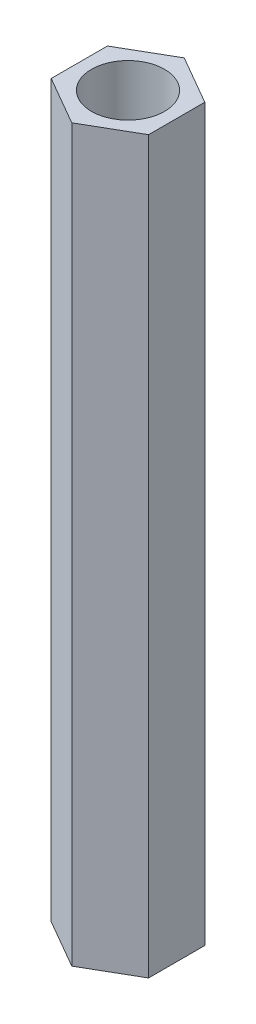
ISO-10303-21;
HEADER;
FILE_DESCRIPTION(('STEP AP214'),'2;1');
FILE_NAME('part.step','',(''),(''),'','','');
FILE_SCHEMA(('AUTOMOTIVE_DESIGN { 1 0 10303 214 1 1 1 1 }'));
ENDSEC;
DATA;
#1=APPLICATION_CONTEXT('core data for automotive mechanical design processes');
#2=APPLICATION_PROTOCOL_DEFINITION('international standard','automotive_design',2000,#1);
#3=PRODUCT_CONTEXT('',#1,'mechanical');
#4=PRODUCT('Part','Part','',(#3));
#5=PRODUCT_RELATED_PRODUCT_CATEGORY('part','',(#4));
#6=PRODUCT_DEFINITION_FORMATION('','',#4);
#7=PRODUCT_DEFINITION_CONTEXT('part definition',#1,'design');
#8=PRODUCT_DEFINITION('design','',#6,#7);
#9=PRODUCT_DEFINITION_SHAPE('','',#8);
#10=(LENGTH_UNIT() NAMED_UNIT(*) SI_UNIT(.MILLI.,.METRE.));
#11=(NAMED_UNIT(*) PLANE_ANGLE_UNIT() SI_UNIT($,.RADIAN.));
#12=(NAMED_UNIT(*) SI_UNIT($,.STERADIAN.) SOLID_ANGLE_UNIT());
#13=UNCERTAINTY_MEASURE_WITH_UNIT(LENGTH_MEASURE(1.E-05),#10,'distance_accuracy_value','');
#14=(GEOMETRIC_REPRESENTATION_CONTEXT(3) GLOBAL_UNCERTAINTY_ASSIGNED_CONTEXT((#13)) GLOBAL_UNIT_ASSIGNED_CONTEXT((#10,
#11,#12)) REPRESENTATION_CONTEXT('',''));
#15=CARTESIAN_POINT('',(0.,0.,0.));
#16=DIRECTION('',(0.,0.,1.));
#17=DIRECTION('',(1.,0.,0.));
#18=AXIS2_PLACEMENT_3D('',#15,#16,#17);
#19=CARTESIAN_POINT('',(0.,30.,0.));
#20=DIRECTION('',(0.,1.,0.));
#21=DIRECTION('',(0.,0.,1.));
#22=AXIS2_PLACEMENT_3D('',#19,#20,#21);
#23=PLANE('',#22);
#24=DIRECTION('',(-0.866025403784439,0.,-0.5));
#25=VECTOR('',#24,1.);
#26=CARTESIAN_POINT('',(2.,30.,-1.15470053837925));
#27=LINE('',#26,#25);
#28=CARTESIAN_POINT('',(2.,30.,-1.15470053837925));
#29=VERTEX_POINT('',#28);
#30=CARTESIAN_POINT('',(0.,30.,-2.3094010767585));
#31=VERTEX_POINT('',#30);
#32=EDGE_CURVE('E130',#29,#31,#27,.T.);
#33=ORIENTED_EDGE('',*,*,#32,.T.);
#34=DIRECTION('',(-0.866025403784438,0.,0.5));
#35=VECTOR('',#34,1.);
#36=CARTESIAN_POINT('',(0.,30.,-2.3094010767585));
#37=LINE('',#36,#35);
#38=CARTESIAN_POINT('',(-2.,30.,-1.15470053837925));
#39=VERTEX_POINT('',#38);
#40=EDGE_CURVE('E88',#31,#39,#37,.T.);
#41=ORIENTED_EDGE('',*,*,#40,.T.);
#42=DIRECTION('',(0.,0.,1.));
#43=VECTOR('',#42,1.);
#44=CARTESIAN_POINT('',(-2.,30.,-1.15470053837925));
#45=LINE('',#44,#43);
#46=CARTESIAN_POINT('',(-2.,30.,1.15470053837925));
#47=VERTEX_POINT('',#46);
#48=EDGE_CURVE('E101',#39,#47,#45,.T.);
#49=ORIENTED_EDGE('',*,*,#48,.T.);
#50=DIRECTION('',(0.866025403784439,0.,0.5));
#51=VECTOR('',#50,1.);
#52=CARTESIAN_POINT('',(-2.,30.,1.15470053837925));
#53=LINE('',#52,#51);
#54=CARTESIAN_POINT('',(0.,30.,2.3094010767585));
#55=VERTEX_POINT('',#54);
#56=EDGE_CURVE('E95',#47,#55,#53,.T.);
#57=ORIENTED_EDGE('',*,*,#56,.T.);
#58=DIRECTION('',(0.866025403784438,0.,-0.5));
#59=VECTOR('',#58,1.);
#60=CARTESIAN_POINT('',(0.,30.,2.3094010767585));
#61=LINE('',#60,#59);
#62=CARTESIAN_POINT('',(2.,30.,1.15470053837925));
#63=VERTEX_POINT('',#62);
#64=EDGE_CURVE('E99',#55,#63,#61,.T.);
#65=ORIENTED_EDGE('',*,*,#64,.T.);
#66=DIRECTION('',(0.,0.,-1.));
#67=VECTOR('',#66,1.);
#68=CARTESIAN_POINT('',(2.,30.,1.15470053837925));
#69=LINE('',#68,#67);
#70=EDGE_CURVE('E51',#63,#29,#69,.T.);
#71=ORIENTED_EDGE('',*,*,#70,.T.);
#72=EDGE_LOOP('',(#33,#41,#49,#57,#65,#71));
#73=FACE_BOUND('',#72,.T.);
#74=CARTESIAN_POINT('',(0.,30.,0.));
#75=DIRECTION('',(0.,1.,0.));
#76=DIRECTION('',(0.,0.,1.));
#77=AXIS2_PLACEMENT_3D('',#74,#75,#76);
#78=CIRCLE('',#77,1.5);
#79=CARTESIAN_POINT('',(0.,30.,1.5));
#80=VERTEX_POINT('',#79);
#81=EDGE_CURVE('E123',#80,#80,#78,.T.);
#82=ORIENTED_EDGE('',*,*,#81,.F.);
#83=EDGE_LOOP('',(#82));
#84=FACE_BOUND('',#83,.T.);
#85=ADVANCED_FACE('F34',(#73,#84),#23,.T.);
#86=CARTESIAN_POINT('',(0.,0.,0.));
#87=DIRECTION('',(0.,1.,0.));
#88=DIRECTION('',(0.,0.,1.));
#89=AXIS2_PLACEMENT_3D('',#86,#87,#88);
#90=PLANE('',#89);
#91=DIRECTION('',(-0.866025403784439,0.,-0.5));
#92=VECTOR('',#91,1.);
#93=CARTESIAN_POINT('',(2.,0.,-1.15470053837925));
#94=LINE('',#93,#92);
#95=CARTESIAN_POINT('',(2.,0.,-1.15470053837925));
#96=VERTEX_POINT('',#95);
#97=CARTESIAN_POINT('',(0.,0.,-2.3094010767585));
#98=VERTEX_POINT('',#97);
#99=EDGE_CURVE('E119',#96,#98,#94,.T.);
#100=ORIENTED_EDGE('',*,*,#99,.F.);
#101=DIRECTION('',(0.,0.,-1.));
#102=VECTOR('',#101,1.);
#103=CARTESIAN_POINT('',(2.,0.,1.15470053837925));
#104=LINE('',#103,#102);
#105=CARTESIAN_POINT('',(2.,0.,1.15470053837925));
#106=VERTEX_POINT('',#105);
#107=EDGE_CURVE('E80',#106,#96,#104,.T.);
#108=ORIENTED_EDGE('',*,*,#107,.F.);
#109=DIRECTION('',(0.866025403784438,0.,-0.5));
#110=VECTOR('',#109,1.);
#111=CARTESIAN_POINT('',(0.,0.,2.3094010767585));
#112=LINE('',#111,#110);
#113=CARTESIAN_POINT('',(0.,0.,2.3094010767585));
#114=VERTEX_POINT('',#113);
#115=EDGE_CURVE('E74',#114,#106,#112,.T.);
#116=ORIENTED_EDGE('',*,*,#115,.F.);
#117=DIRECTION('',(0.866025403784439,0.,0.5));
#118=VECTOR('',#117,1.);
#119=CARTESIAN_POINT('',(-2.,0.,1.15470053837925));
#120=LINE('',#119,#118);
#121=CARTESIAN_POINT('',(-2.,0.,1.15470053837925));
#122=VERTEX_POINT('',#121);
#123=EDGE_CURVE('E109',#122,#114,#120,.T.);
#124=ORIENTED_EDGE('',*,*,#123,.F.);
#125=DIRECTION('',(0.,0.,1.));
#126=VECTOR('',#125,1.);
#127=CARTESIAN_POINT('',(-2.,0.,-1.15470053837925));
#128=LINE('',#127,#126);
#129=CARTESIAN_POINT('',(-2.,0.,-1.15470053837925));
#130=VERTEX_POINT('',#129);
#131=EDGE_CURVE('E125',#130,#122,#128,.T.);
#132=ORIENTED_EDGE('',*,*,#131,.F.);
#133=DIRECTION('',(-0.866025403784438,0.,0.5));
#134=VECTOR('',#133,1.);
#135=CARTESIAN_POINT('',(0.,0.,-2.3094010767585));
#136=LINE('',#135,#134);
#137=EDGE_CURVE('E122',#98,#130,#136,.T.);
#138=ORIENTED_EDGE('',*,*,#137,.F.);
#139=EDGE_LOOP('',(#100,#108,#116,#124,#132,#138));
#140=FACE_BOUND('',#139,.T.);
#141=CARTESIAN_POINT('',(0.,0.,0.));
#142=DIRECTION('',(0.,1.,0.));
#143=DIRECTION('',(0.,0.,1.));
#144=AXIS2_PLACEMENT_3D('',#141,#142,#143);
#145=CIRCLE('',#144,1.5);
#146=CARTESIAN_POINT('',(0.,0.,1.5));
#147=VERTEX_POINT('',#146);
#148=EDGE_CURVE('E223',#147,#147,#145,.T.);
#149=ORIENTED_EDGE('',*,*,#148,.T.);
#150=EDGE_LOOP('',(#149));
#151=FACE_BOUND('',#150,.T.);
#152=ADVANCED_FACE('F139',(#140,#151),#90,.F.);
#153=CARTESIAN_POINT('',(2.,30.,-1.15470053837925));
#154=DIRECTION('',(-0.5,0.,0.866025403784439));
#155=DIRECTION('',(0.866025403784439,0.,0.5));
#156=AXIS2_PLACEMENT_3D('',#153,#154,#155);
#157=PLANE('',#156);
#158=ORIENTED_EDGE('',*,*,#99,.T.);
#159=DIRECTION('',(0.,-1.,0.));
#160=VECTOR('',#159,1.);
#161=CARTESIAN_POINT('',(0.,30.,-2.3094010767585));
#162=LINE('',#161,#160);
#163=EDGE_CURVE('E11',#31,#98,#162,.T.);
#164=ORIENTED_EDGE('',*,*,#163,.F.);
#165=ORIENTED_EDGE('',*,*,#32,.F.);
#166=DIRECTION('',(0.,-1.,0.));
#167=VECTOR('',#166,1.);
#168=CARTESIAN_POINT('',(2.,30.,-1.15470053837925));
#169=LINE('',#168,#167);
#170=EDGE_CURVE('E115',#29,#96,#169,.T.);
#171=ORIENTED_EDGE('',*,*,#170,.T.);
#172=EDGE_LOOP('',(#158,#164,#165,#171));
#173=FACE_BOUND('',#172,.T.);
#174=ADVANCED_FACE('F36',(#173),#157,.F.);
#175=CARTESIAN_POINT('',(0.,30.,-2.3094010767585));
#176=DIRECTION('',(0.5,0.,0.866025403784438));
#177=DIRECTION('',(0.866025403784439,0.,-0.5));
#178=AXIS2_PLACEMENT_3D('',#175,#176,#177);
#179=PLANE('',#178);
#180=ORIENTED_EDGE('',*,*,#137,.T.);
#181=DIRECTION('',(0.,-1.,0.));
#182=VECTOR('',#181,1.);
#183=CARTESIAN_POINT('',(-2.,30.,-1.15470053837925));
#184=LINE('',#183,#182);
#185=EDGE_CURVE('E43',#39,#130,#184,.T.);
#186=ORIENTED_EDGE('',*,*,#185,.F.);
#187=ORIENTED_EDGE('',*,*,#40,.F.);
#188=ORIENTED_EDGE('',*,*,#163,.T.);
#189=EDGE_LOOP('',(#180,#186,#187,#188));
#190=FACE_BOUND('',#189,.T.);
#191=ADVANCED_FACE('F164',(#190),#179,.F.);
#192=CARTESIAN_POINT('',(-2.,30.,-1.15470053837925));
#193=DIRECTION('',(1.,0.,0.));
#194=DIRECTION('',(0.,0.,-1.));
#195=AXIS2_PLACEMENT_3D('',#192,#193,#194);
#196=PLANE('',#195);
#197=ORIENTED_EDGE('',*,*,#131,.T.);
#198=DIRECTION('',(0.,-1.,0.));
#199=VECTOR('',#198,1.);
#200=CARTESIAN_POINT('',(-2.,30.,1.15470053837925));
#201=LINE('',#200,#199);
#202=EDGE_CURVE('E110',#47,#122,#201,.T.);
#203=ORIENTED_EDGE('',*,*,#202,.F.);
#204=ORIENTED_EDGE('',*,*,#48,.F.);
#205=ORIENTED_EDGE('',*,*,#185,.T.);
#206=EDGE_LOOP('',(#197,#203,#204,#205));
#207=FACE_BOUND('',#206,.T.);
#208=ADVANCED_FACE('F136',(#207),#196,.F.);
#209=CARTESIAN_POINT('',(-2.,30.,1.15470053837925));
#210=DIRECTION('',(0.5,0.,-0.866025403784439));
#211=DIRECTION('',(-0.866025403784439,0.,-0.5));
#212=AXIS2_PLACEMENT_3D('',#209,#210,#211);
#213=PLANE('',#212);
#214=ORIENTED_EDGE('',*,*,#123,.T.);
#215=DIRECTION('',(0.,-1.,0.));
#216=VECTOR('',#215,1.);
#217=CARTESIAN_POINT('',(0.,30.,2.3094010767585));
#218=LINE('',#217,#216);
#219=EDGE_CURVE('E106',#55,#114,#218,.T.);
#220=ORIENTED_EDGE('',*,*,#219,.F.);
#221=ORIENTED_EDGE('',*,*,#56,.F.);
#222=ORIENTED_EDGE('',*,*,#202,.T.);
#223=EDGE_LOOP('',(#214,#220,#221,#222));
#224=FACE_BOUND('',#223,.T.);
#225=ADVANCED_FACE('F107',(#224),#213,.F.);
#226=CARTESIAN_POINT('',(0.,30.,2.3094010767585));
#227=DIRECTION('',(-0.5,0.,-0.866025403784438));
#228=DIRECTION('',(-0.866025403784439,0.,0.5));
#229=AXIS2_PLACEMENT_3D('',#226,#227,#228);
#230=PLANE('',#229);
#231=ORIENTED_EDGE('',*,*,#115,.T.);
#232=DIRECTION('',(0.,-1.,0.));
#233=VECTOR('',#232,1.);
#234=CARTESIAN_POINT('',(2.,30.,1.15470053837925));
#235=LINE('',#234,#233);
#236=EDGE_CURVE('E111',#63,#106,#235,.T.);
#237=ORIENTED_EDGE('',*,*,#236,.F.);
#238=ORIENTED_EDGE('',*,*,#64,.F.);
#239=ORIENTED_EDGE('',*,*,#219,.T.);
#240=EDGE_LOOP('',(#231,#237,#238,#239));
#241=FACE_BOUND('',#240,.T.);
#242=ADVANCED_FACE('F113',(#241),#230,.F.);
#243=CARTESIAN_POINT('',(2.,30.,1.15470053837925));
#244=DIRECTION('',(-1.,0.,0.));
#245=DIRECTION('',(0.,0.,1.));
#246=AXIS2_PLACEMENT_3D('',#243,#244,#245);
#247=PLANE('',#246);
#248=ORIENTED_EDGE('',*,*,#107,.T.);
#249=ORIENTED_EDGE('',*,*,#170,.F.);
#250=ORIENTED_EDGE('',*,*,#70,.F.);
#251=ORIENTED_EDGE('',*,*,#236,.T.);
#252=EDGE_LOOP('',(#248,#249,#250,#251));
#253=FACE_BOUND('',#252,.T.);
#254=ADVANCED_FACE('F144',(#253),#247,.F.);
#255=CARTESIAN_POINT('',(0.,30.,0.));
#256=DIRECTION('',(0.,-1.,0.));
#257=DIRECTION('',(0.,0.,-1.));
#258=AXIS2_PLACEMENT_3D('',#255,#256,#257);
#259=CYLINDRICAL_SURFACE('',#258,1.5);
#260=ORIENTED_EDGE('',*,*,#81,.T.);
#261=EDGE_LOOP('',(#260));
#262=FACE_BOUND('',#261,.T.);
#263=ORIENTED_EDGE('',*,*,#148,.F.);
#264=EDGE_LOOP('',(#263));
#265=FACE_BOUND('',#264,.T.);
#266=ADVANCED_FACE('F146',(#262,#265),#259,.F.);
#267=CLOSED_SHELL('',(#85,#152,#174,#191,#208,#225,#242,#254,#266));
#268=MANIFOLD_SOLID_BREP('B2',#267);
#269=ADVANCED_BREP_SHAPE_REPRESENTATION('',(#18,#268),#14);
#270=SHAPE_DEFINITION_REPRESENTATION(#9,#269);
ENDSEC;
END-ISO-10303-21;
